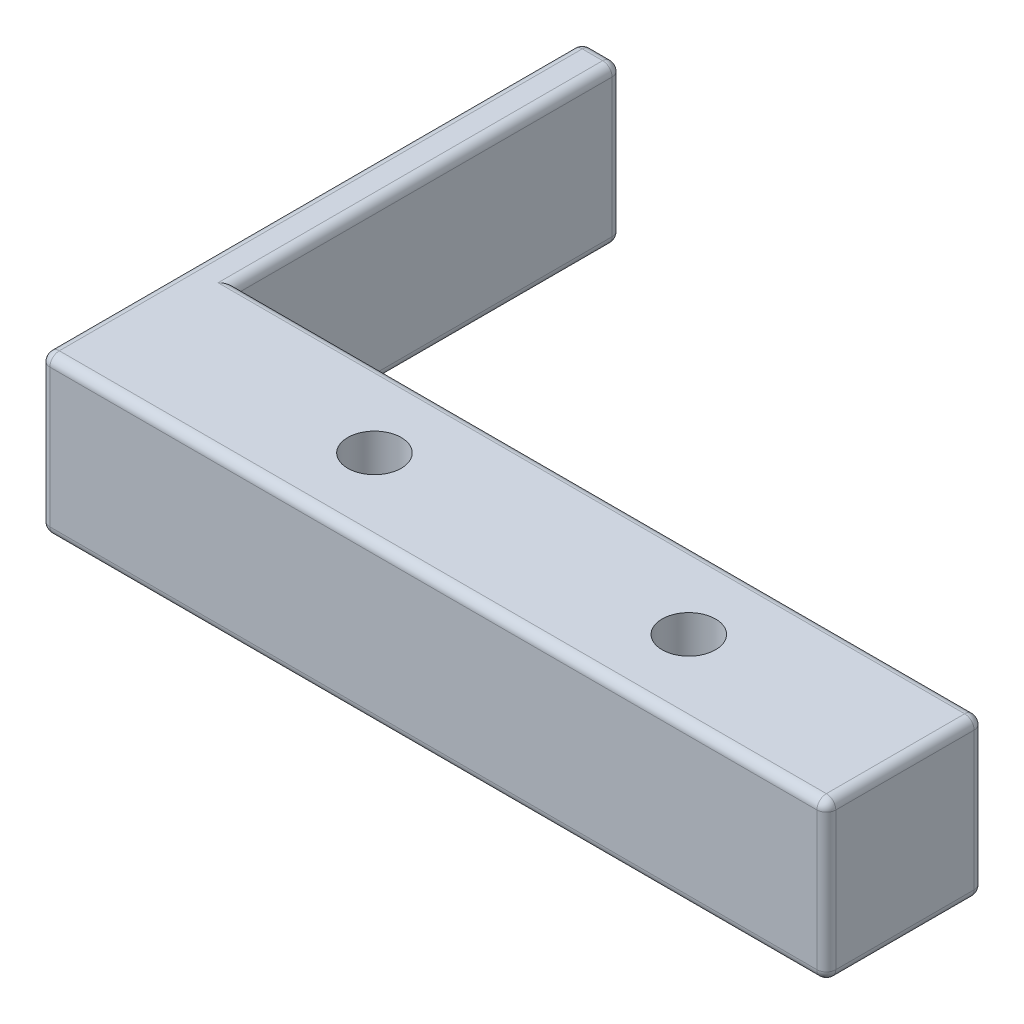
ISO-10303-21;
HEADER;
FILE_DESCRIPTION(('STEP AP214'),'2;1');
FILE_NAME('part.step','',(''),(''),'','','');
FILE_SCHEMA(('AUTOMOTIVE_DESIGN { 1 0 10303 214 1 1 1 1 }'));
ENDSEC;
DATA;
#1=APPLICATION_CONTEXT('core data for automotive mechanical design processes');
#2=APPLICATION_PROTOCOL_DEFINITION('international standard','automotive_design',2000,#1);
#3=PRODUCT_CONTEXT('',#1,'mechanical');
#4=PRODUCT('Part','Part','',(#3));
#5=PRODUCT_RELATED_PRODUCT_CATEGORY('part','',(#4));
#6=PRODUCT_DEFINITION_FORMATION('','',#4);
#7=PRODUCT_DEFINITION_CONTEXT('part definition',#1,'design');
#8=PRODUCT_DEFINITION('design','',#6,#7);
#9=PRODUCT_DEFINITION_SHAPE('','',#8);
#10=(LENGTH_UNIT() NAMED_UNIT(*) SI_UNIT(.MILLI.,.METRE.));
#11=(NAMED_UNIT(*) PLANE_ANGLE_UNIT() SI_UNIT($,.RADIAN.));
#12=(NAMED_UNIT(*) SI_UNIT($,.STERADIAN.) SOLID_ANGLE_UNIT());
#13=UNCERTAINTY_MEASURE_WITH_UNIT(LENGTH_MEASURE(1.E-05),#10,'distance_accuracy_value','');
#14=(GEOMETRIC_REPRESENTATION_CONTEXT(3) GLOBAL_UNCERTAINTY_ASSIGNED_CONTEXT((#13)) GLOBAL_UNIT_ASSIGNED_CONTEXT((#10,
#11,#12)) REPRESENTATION_CONTEXT('',''));
#15=CARTESIAN_POINT('',(0.,0.,0.));
#16=DIRECTION('',(0.,0.,1.));
#17=DIRECTION('',(1.,0.,0.));
#18=AXIS2_PLACEMENT_3D('',#15,#16,#17);
#19=CARTESIAN_POINT('',(42.8625,12.7,-6.35));
#20=DIRECTION('',(0.,-1.,0.));
#21=DIRECTION('',(0.,0.,-1.));
#22=AXIS2_PLACEMENT_3D('',#19,#20,#21);
#23=CYLINDRICAL_SURFACE('',#22,2.159);
#24=CARTESIAN_POINT('',(42.8625,12.7,-6.35));
#25=DIRECTION('',(0.,1.,0.));
#26=DIRECTION('',(0.,0.,1.));
#27=AXIS2_PLACEMENT_3D('',#24,#25,#26);
#28=CIRCLE('',#27,2.159);
#29=CARTESIAN_POINT('',(42.8625,12.7,-4.191));
#30=VERTEX_POINT('',#29);
#31=EDGE_CURVE('E267',#30,#30,#28,.T.);
#32=ORIENTED_EDGE('',*,*,#31,.T.);
#33=EDGE_LOOP('',(#32));
#34=FACE_BOUND('',#33,.T.);
#35=CARTESIAN_POINT('',(42.8625,3.81,-6.35));
#36=DIRECTION('',(0.,-1.,0.));
#37=DIRECTION('',(0.,0.,-1.));
#38=AXIS2_PLACEMENT_3D('',#35,#36,#37);
#39=CIRCLE('',#38,2.159);
#40=CARTESIAN_POINT('',(42.8625,3.81,-8.509));
#41=VERTEX_POINT('',#40);
#42=EDGE_CURVE('E268',#41,#41,#39,.T.);
#43=ORIENTED_EDGE('',*,*,#42,.T.);
#44=EDGE_LOOP('',(#43));
#45=FACE_BOUND('',#44,.T.);
#46=ADVANCED_FACE('F33',(#34,#45),#23,.F.);
#47=CARTESIAN_POINT('',(17.4625,12.7,-6.35));
#48=DIRECTION('',(0.,-1.,0.));
#49=DIRECTION('',(0.,0.,-1.));
#50=AXIS2_PLACEMENT_3D('',#47,#48,#49);
#51=CYLINDRICAL_SURFACE('',#50,2.159);
#52=CARTESIAN_POINT('',(17.4625,12.7,-6.35));
#53=DIRECTION('',(0.,1.,0.));
#54=DIRECTION('',(0.,0.,1.));
#55=AXIS2_PLACEMENT_3D('',#52,#53,#54);
#56=CIRCLE('',#55,2.159);
#57=CARTESIAN_POINT('',(17.4625,12.7,-4.191));
#58=VERTEX_POINT('',#57);
#59=EDGE_CURVE('E264',#58,#58,#56,.T.);
#60=ORIENTED_EDGE('',*,*,#59,.T.);
#61=EDGE_LOOP('',(#60));
#62=FACE_BOUND('',#61,.T.);
#63=CARTESIAN_POINT('',(17.4625,3.81,-6.35));
#64=DIRECTION('',(0.,-1.,0.));
#65=DIRECTION('',(0.,0.,-1.));
#66=AXIS2_PLACEMENT_3D('',#63,#64,#65);
#67=CIRCLE('',#66,2.159);
#68=CARTESIAN_POINT('',(17.4625,3.81,-8.509));
#69=VERTEX_POINT('',#68);
#70=EDGE_CURVE('E261',#69,#69,#67,.T.);
#71=ORIENTED_EDGE('',*,*,#70,.T.);
#72=EDGE_LOOP('',(#71));
#73=FACE_BOUND('',#72,.T.);
#74=ADVANCED_FACE('F478',(#62,#73),#51,.F.);
#75=CARTESIAN_POINT('',(0.,12.7,0.));
#76=DIRECTION('',(0.,1.,0.));
#77=DIRECTION('',(0.,0.,1.));
#78=AXIS2_PLACEMENT_3D('',#75,#76,#77);
#79=PLANE('',#78);
#80=DIRECTION('',(0.,0.,-1.));
#81=VECTOR('',#80,1.);
#82=CARTESIAN_POINT('',(-0.761999999999997,12.7,-43.7752593089877));
#83=LINE('',#82,#81);
#84=CARTESIAN_POINT('',(-0.761999999999999,12.7,-11.938));
#85=VERTEX_POINT('',#84);
#86=CARTESIAN_POINT('',(-0.761999999999997,12.7,-43.0132593089877));
#87=VERTEX_POINT('',#86);
#88=EDGE_CURVE('E304',#85,#87,#83,.T.);
#89=ORIENTED_EDGE('',*,*,#88,.T.);
#90=DIRECTION('',(1.,0.,0.));
#91=VECTOR('',#90,1.);
#92=CARTESIAN_POINT('',(-3.175,12.7,-43.0132593089877));
#93=LINE('',#92,#91);
#94=CARTESIAN_POINT('',(-2.413,12.7,-43.0132593089877));
#95=VERTEX_POINT('',#94);
#96=EDGE_CURVE('E314',#87,#95,#93,.F.);
#97=ORIENTED_EDGE('',*,*,#96,.T.);
#98=DIRECTION('',(0.,0.,-1.));
#99=VECTOR('',#98,1.);
#100=CARTESIAN_POINT('',(-2.413,12.7,0.));
#101=LINE('',#100,#99);
#102=CARTESIAN_POINT('',(-2.413,12.7,-0.762));
#103=VERTEX_POINT('',#102);
#104=EDGE_CURVE('E312',#95,#103,#101,.F.);
#105=ORIENTED_EDGE('',*,*,#104,.T.);
#106=DIRECTION('',(1.,0.,0.));
#107=VECTOR('',#106,1.);
#108=CARTESIAN_POINT('',(60.325,12.7,-0.761999999999999));
#109=LINE('',#108,#107);
#110=CARTESIAN_POINT('',(59.563,12.7,-0.761999999999999));
#111=VERTEX_POINT('',#110);
#112=EDGE_CURVE('E310',#103,#111,#109,.T.);
#113=ORIENTED_EDGE('',*,*,#112,.T.);
#114=DIRECTION('',(0.,0.,-1.));
#115=VECTOR('',#114,1.);
#116=CARTESIAN_POINT('',(59.563,12.7,-12.7));
#117=LINE('',#116,#115);
#118=CARTESIAN_POINT('',(59.563,12.7,-11.938));
#119=VERTEX_POINT('',#118);
#120=EDGE_CURVE('E308',#111,#119,#117,.T.);
#121=ORIENTED_EDGE('',*,*,#120,.T.);
#122=DIRECTION('',(-1.,0.,0.));
#123=VECTOR('',#122,1.);
#124=CARTESIAN_POINT('',(0.,12.7,-11.938));
#125=LINE('',#124,#123);
#126=EDGE_CURVE('E306',#119,#85,#125,.T.);
#127=ORIENTED_EDGE('',*,*,#126,.T.);
#128=EDGE_LOOP('',(#89,#97,#105,#113,#121,#127));
#129=FACE_BOUND('',#128,.T.);
#130=ORIENTED_EDGE('',*,*,#31,.F.);
#131=EDGE_LOOP('',(#130));
#132=FACE_BOUND('',#131,.T.);
#133=ORIENTED_EDGE('',*,*,#59,.F.);
#134=EDGE_LOOP('',(#133));
#135=FACE_BOUND('',#134,.T.);
#136=ADVANCED_FACE('F407',(#129,#132,#135),#79,.T.);
#137=CARTESIAN_POINT('',(0.,0.,0.));
#138=DIRECTION('',(0.,1.,0.));
#139=DIRECTION('',(0.,0.,1.));
#140=AXIS2_PLACEMENT_3D('',#137,#138,#139);
#141=PLANE('',#140);
#142=CARTESIAN_POINT('',(17.4625,0.,-6.35));
#143=DIRECTION('',(0.,1.,0.));
#144=DIRECTION('',(0.,0.,1.));
#145=AXIS2_PLACEMENT_3D('',#142,#143,#144);
#146=CIRCLE('',#145,4.318);
#147=CARTESIAN_POINT('',(17.4625,0.,-2.032));
#148=VERTEX_POINT('',#147);
#149=EDGE_CURVE('E289',#148,#148,#146,.T.);
#150=ORIENTED_EDGE('',*,*,#149,.T.);
#151=EDGE_LOOP('',(#150));
#152=FACE_BOUND('',#151,.T.);
#153=CARTESIAN_POINT('',(42.8625,0.,-6.35));
#154=DIRECTION('',(0.,1.,0.));
#155=DIRECTION('',(0.,0.,1.));
#156=AXIS2_PLACEMENT_3D('',#153,#154,#155);
#157=CIRCLE('',#156,4.31800000000001);
#158=CARTESIAN_POINT('',(42.8625,0.,-2.03199999999999));
#159=VERTEX_POINT('',#158);
#160=EDGE_CURVE('E286',#159,#159,#157,.T.);
#161=ORIENTED_EDGE('',*,*,#160,.T.);
#162=EDGE_LOOP('',(#161));
#163=FACE_BOUND('',#162,.T.);
#164=DIRECTION('',(1.,0.,0.));
#165=VECTOR('',#164,1.);
#166=CARTESIAN_POINT('',(0.,0.,-0.762));
#167=LINE('',#166,#165);
#168=CARTESIAN_POINT('',(59.563,0.,-0.761999999999999));
#169=VERTEX_POINT('',#168);
#170=CARTESIAN_POINT('',(-2.413,0.,-0.762));
#171=VERTEX_POINT('',#170);
#172=EDGE_CURVE('E282',#169,#171,#167,.F.);
#173=ORIENTED_EDGE('',*,*,#172,.T.);
#174=DIRECTION('',(0.,0.,1.));
#175=VECTOR('',#174,1.);
#176=CARTESIAN_POINT('',(-2.413,0.,-43.7752593089877));
#177=LINE('',#176,#175);
#178=CARTESIAN_POINT('',(-2.413,0.,-43.0132593089877));
#179=VERTEX_POINT('',#178);
#180=EDGE_CURVE('E284',#171,#179,#177,.F.);
#181=ORIENTED_EDGE('',*,*,#180,.T.);
#182=DIRECTION('',(1.,0.,0.));
#183=VECTOR('',#182,1.);
#184=CARTESIAN_POINT('',(0.,0.,-43.0132593089877));
#185=LINE('',#184,#183);
#186=CARTESIAN_POINT('',(-0.761999999999997,0.,-43.0132593089877));
#187=VERTEX_POINT('',#186);
#188=EDGE_CURVE('E157',#179,#187,#185,.T.);
#189=ORIENTED_EDGE('',*,*,#188,.T.);
#190=DIRECTION('',(0.,0.,1.));
#191=VECTOR('',#190,1.);
#192=CARTESIAN_POINT('',(-0.762,0.,0.));
#193=LINE('',#192,#191);
#194=CARTESIAN_POINT('',(-0.761999999999999,0.,-11.938));
#195=VERTEX_POINT('',#194);
#196=EDGE_CURVE('E151',#187,#195,#193,.T.);
#197=ORIENTED_EDGE('',*,*,#196,.T.);
#198=DIRECTION('',(-1.,0.,0.));
#199=VECTOR('',#198,1.);
#200=CARTESIAN_POINT('',(0.,0.,-11.938));
#201=LINE('',#200,#199);
#202=CARTESIAN_POINT('',(59.563,0.,-11.938));
#203=VERTEX_POINT('',#202);
#204=EDGE_CURVE('E154',#195,#203,#201,.F.);
#205=ORIENTED_EDGE('',*,*,#204,.T.);
#206=DIRECTION('',(0.,0.,-1.));
#207=VECTOR('',#206,1.);
#208=CARTESIAN_POINT('',(59.563,0.,0.));
#209=LINE('',#208,#207);
#210=EDGE_CURVE('E161',#203,#169,#209,.F.);
#211=ORIENTED_EDGE('',*,*,#210,.T.);
#212=EDGE_LOOP('',(#173,#181,#189,#197,#205,#211));
#213=FACE_BOUND('',#212,.T.);
#214=ADVANCED_FACE('F153',(#152,#163,#213),#141,.F.);
#215=CARTESIAN_POINT('',(0.,12.7,0.));
#216=DIRECTION('',(0.,0.,-1.));
#217=DIRECTION('',(-1.,0.,0.));
#218=AXIS2_PLACEMENT_3D('',#215,#216,#217);
#219=PLANE('',#218);
#220=DIRECTION('',(0.,1.,0.));
#221=VECTOR('',#220,1.);
#222=CARTESIAN_POINT('',(-2.413,0.,0.));
#223=LINE('',#222,#221);
#224=CARTESIAN_POINT('',(-2.413,11.938,0.));
#225=VERTEX_POINT('',#224);
#226=CARTESIAN_POINT('',(-2.413,0.762000000000001,0.));
#227=VERTEX_POINT('',#226);
#228=EDGE_CURVE('E336',#225,#227,#223,.F.);
#229=ORIENTED_EDGE('',*,*,#228,.T.);
#230=DIRECTION('',(1.,0.,0.));
#231=VECTOR('',#230,1.);
#232=CARTESIAN_POINT('',(0.,0.762000000000001,0.));
#233=LINE('',#232,#231);
#234=CARTESIAN_POINT('',(59.563,0.762000000000001,0.));
#235=VERTEX_POINT('',#234);
#236=EDGE_CURVE('E339',#227,#235,#233,.T.);
#237=ORIENTED_EDGE('',*,*,#236,.T.);
#238=DIRECTION('',(0.,-1.,0.));
#239=VECTOR('',#238,1.);
#240=CARTESIAN_POINT('',(59.563,12.7,0.));
#241=LINE('',#240,#239);
#242=CARTESIAN_POINT('',(59.563,11.938,0.));
#243=VERTEX_POINT('',#242);
#244=EDGE_CURVE('E334',#235,#243,#241,.F.);
#245=ORIENTED_EDGE('',*,*,#244,.T.);
#246=DIRECTION('',(1.,0.,0.));
#247=VECTOR('',#246,1.);
#248=CARTESIAN_POINT('',(-3.175,11.938,0.));
#249=LINE('',#248,#247);
#250=EDGE_CURVE('E332',#243,#225,#249,.F.);
#251=ORIENTED_EDGE('',*,*,#250,.T.);
#252=EDGE_LOOP('',(#229,#237,#245,#251));
#253=FACE_BOUND('',#252,.T.);
#254=ADVANCED_FACE('F431',(#253),#219,.F.);
#255=CARTESIAN_POINT('',(60.325,12.7,-12.7));
#256=DIRECTION('',(-1.,0.,0.));
#257=DIRECTION('',(0.,0.,1.));
#258=AXIS2_PLACEMENT_3D('',#255,#256,#257);
#259=PLANE('',#258);
#260=DIRECTION('',(0.,-1.,0.));
#261=VECTOR('',#260,1.);
#262=CARTESIAN_POINT('',(60.325,12.7,-0.761999999999999));
#263=LINE('',#262,#261);
#264=CARTESIAN_POINT('',(60.325,11.938,-0.761999999999999));
#265=VERTEX_POINT('',#264);
#266=CARTESIAN_POINT('',(60.325,0.762000000000001,-0.761999999999999));
#267=VERTEX_POINT('',#266);
#268=EDGE_CURVE('E345',#265,#267,#263,.T.);
#269=ORIENTED_EDGE('',*,*,#268,.T.);
#270=DIRECTION('',(0.,0.,-1.));
#271=VECTOR('',#270,1.);
#272=CARTESIAN_POINT('',(60.325,0.762000000000001,-12.7));
#273=LINE('',#272,#271);
#274=CARTESIAN_POINT('',(60.325,0.762000000000001,-11.938));
#275=VERTEX_POINT('',#274);
#276=EDGE_CURVE('E348',#267,#275,#273,.T.);
#277=ORIENTED_EDGE('',*,*,#276,.T.);
#278=DIRECTION('',(0.,-1.,0.));
#279=VECTOR('',#278,1.);
#280=CARTESIAN_POINT('',(60.325,12.7,-11.938));
#281=LINE('',#280,#279);
#282=CARTESIAN_POINT('',(60.325,11.938,-11.938));
#283=VERTEX_POINT('',#282);
#284=EDGE_CURVE('E343',#275,#283,#281,.F.);
#285=ORIENTED_EDGE('',*,*,#284,.T.);
#286=DIRECTION('',(0.,0.,-1.));
#287=VECTOR('',#286,1.);
#288=CARTESIAN_POINT('',(60.325,11.938,0.));
#289=LINE('',#288,#287);
#290=EDGE_CURVE('E341',#283,#265,#289,.F.);
#291=ORIENTED_EDGE('',*,*,#290,.T.);
#292=EDGE_LOOP('',(#269,#277,#285,#291));
#293=FACE_BOUND('',#292,.T.);
#294=ADVANCED_FACE('F495',(#293),#259,.F.);
#295=CARTESIAN_POINT('',(0.,12.7,-12.7));
#296=DIRECTION('',(0.,0.,1.));
#297=DIRECTION('',(1.,0.,0.));
#298=AXIS2_PLACEMENT_3D('',#295,#296,#297);
#299=PLANE('',#298);
#300=DIRECTION('',(0.,-1.,0.));
#301=VECTOR('',#300,1.);
#302=CARTESIAN_POINT('',(0.,12.7,-12.7));
#303=LINE('',#302,#301);
#304=CARTESIAN_POINT('',(0.,11.938,-12.7));
#305=VERTEX_POINT('',#304);
#306=CARTESIAN_POINT('',(0.,0.762000000000001,-12.7));
#307=VERTEX_POINT('',#306);
#308=EDGE_CURVE('E271',#305,#307,#303,.T.);
#309=ORIENTED_EDGE('',*,*,#308,.F.);
#310=DIRECTION('',(-1.,0.,0.));
#311=VECTOR('',#310,1.);
#312=CARTESIAN_POINT('',(60.325,11.938,-12.7));
#313=LINE('',#312,#311);
#314=CARTESIAN_POINT('',(59.563,11.938,-12.7));
#315=VERTEX_POINT('',#314);
#316=EDGE_CURVE('E11',#305,#315,#313,.F.);
#317=ORIENTED_EDGE('',*,*,#316,.T.);
#318=DIRECTION('',(0.,-1.,0.));
#319=VECTOR('',#318,1.);
#320=CARTESIAN_POINT('',(59.563,12.7,-12.7));
#321=LINE('',#320,#319);
#322=CARTESIAN_POINT('',(59.563,0.762000000000001,-12.7));
#323=VERTEX_POINT('',#322);
#324=EDGE_CURVE('E42',#315,#323,#321,.T.);
#325=ORIENTED_EDGE('',*,*,#324,.T.);
#326=DIRECTION('',(-1.,0.,0.));
#327=VECTOR('',#326,1.);
#328=CARTESIAN_POINT('',(0.,0.762000000000001,-12.7));
#329=LINE('',#328,#327);
#330=EDGE_CURVE('E350',#323,#307,#329,.T.);
#331=ORIENTED_EDGE('',*,*,#330,.T.);
#332=EDGE_LOOP('',(#309,#317,#325,#331));
#333=FACE_BOUND('',#332,.T.);
#334=ADVANCED_FACE('F394',(#333),#299,.F.);
#335=CARTESIAN_POINT('',(0.,0.,0.));
#336=DIRECTION('',(-1.,0.,0.));
#337=DIRECTION('',(0.,0.,1.));
#338=AXIS2_PLACEMENT_3D('',#335,#336,#337);
#339=PLANE('',#338);
#340=DIRECTION('',(0.,-1.,0.));
#341=VECTOR('',#340,1.);
#342=CARTESIAN_POINT('',(0.,0.,-43.0132593089877));
#343=LINE('',#342,#341);
#344=CARTESIAN_POINT('',(0.,0.762,-43.0132593089877));
#345=VERTEX_POINT('',#344);
#346=CARTESIAN_POINT('',(0.,11.938,-43.0132593089877));
#347=VERTEX_POINT('',#346);
#348=EDGE_CURVE('E318',#345,#347,#343,.F.);
#349=ORIENTED_EDGE('',*,*,#348,.T.);
#350=DIRECTION('',(0.,0.,-1.));
#351=VECTOR('',#350,1.);
#352=CARTESIAN_POINT('',(0.,11.938,-12.7));
#353=LINE('',#352,#351);
#354=EDGE_CURVE('E321',#347,#305,#353,.F.);
#355=ORIENTED_EDGE('',*,*,#354,.T.);
#356=ORIENTED_EDGE('',*,*,#308,.T.);
#357=DIRECTION('',(0.,0.,1.));
#358=VECTOR('',#357,1.);
#359=CARTESIAN_POINT('',(0.,0.762,0.));
#360=LINE('',#359,#358);
#361=EDGE_CURVE('E175',#307,#345,#360,.F.);
#362=ORIENTED_EDGE('',*,*,#361,.T.);
#363=EDGE_LOOP('',(#349,#355,#356,#362));
#364=FACE_BOUND('',#363,.T.);
#365=ADVANCED_FACE('F392',(#364),#339,.F.);
#366=CARTESIAN_POINT('',(-3.175,12.7,-43.7752593089877));
#367=DIRECTION('',(0.,0.,1.));
#368=DIRECTION('',(1.,0.,0.));
#369=AXIS2_PLACEMENT_3D('',#366,#367,#368);
#370=PLANE('',#369);
#371=DIRECTION('',(1.,0.,0.));
#372=VECTOR('',#371,1.);
#373=CARTESIAN_POINT('',(0.,11.938,-43.7752593089877));
#374=LINE('',#373,#372);
#375=CARTESIAN_POINT('',(-2.413,11.938,-43.7752593089877));
#376=VERTEX_POINT('',#375);
#377=CARTESIAN_POINT('',(-0.761999999999997,11.938,-43.7752593089877));
#378=VERTEX_POINT('',#377);
#379=EDGE_CURVE('E297',#376,#378,#374,.T.);
#380=ORIENTED_EDGE('',*,*,#379,.T.);
#381=DIRECTION('',(0.,-1.,0.));
#382=VECTOR('',#381,1.);
#383=CARTESIAN_POINT('',(-0.761999999999997,12.7,-43.7752593089877));
#384=LINE('',#383,#382);
#385=CARTESIAN_POINT('',(-0.761999999999997,0.762,-43.7752593089877));
#386=VERTEX_POINT('',#385);
#387=EDGE_CURVE('E302',#378,#386,#384,.T.);
#388=ORIENTED_EDGE('',*,*,#387,.T.);
#389=DIRECTION('',(1.,0.,0.));
#390=VECTOR('',#389,1.);
#391=CARTESIAN_POINT('',(-3.175,0.762000000000001,-43.7752593089877));
#392=LINE('',#391,#390);
#393=CARTESIAN_POINT('',(-2.413,0.762,-43.7752593089877));
#394=VERTEX_POINT('',#393);
#395=EDGE_CURVE('E299',#386,#394,#392,.F.);
#396=ORIENTED_EDGE('',*,*,#395,.T.);
#397=DIRECTION('',(0.,-1.,0.));
#398=VECTOR('',#397,1.);
#399=CARTESIAN_POINT('',(-2.413,12.7,-43.7752593089877));
#400=LINE('',#399,#398);
#401=EDGE_CURVE('E295',#394,#376,#400,.F.);
#402=ORIENTED_EDGE('',*,*,#401,.T.);
#403=EDGE_LOOP('',(#380,#388,#396,#402));
#404=FACE_BOUND('',#403,.T.);
#405=ADVANCED_FACE('F379',(#404),#370,.F.);
#406=CARTESIAN_POINT('',(-3.175,0.,0.));
#407=DIRECTION('',(-1.,0.,0.));
#408=DIRECTION('',(0.,0.,1.));
#409=AXIS2_PLACEMENT_3D('',#406,#407,#408);
#410=PLANE('',#409);
#411=DIRECTION('',(0.,0.,1.));
#412=VECTOR('',#411,1.);
#413=CARTESIAN_POINT('',(-3.175,0.762,0.));
#414=LINE('',#413,#412);
#415=CARTESIAN_POINT('',(-3.175,0.762,-43.0132593089877));
#416=VERTEX_POINT('',#415);
#417=CARTESIAN_POINT('',(-3.175,0.762,-0.762));
#418=VERTEX_POINT('',#417);
#419=EDGE_CURVE('E327',#416,#418,#414,.T.);
#420=ORIENTED_EDGE('',*,*,#419,.T.);
#421=DIRECTION('',(0.,1.,0.));
#422=VECTOR('',#421,1.);
#423=CARTESIAN_POINT('',(-3.175,12.7,-0.762));
#424=LINE('',#423,#422);
#425=CARTESIAN_POINT('',(-3.175,11.938,-0.762));
#426=VERTEX_POINT('',#425);
#427=EDGE_CURVE('E329',#418,#426,#424,.T.);
#428=ORIENTED_EDGE('',*,*,#427,.T.);
#429=DIRECTION('',(0.,0.,-1.));
#430=VECTOR('',#429,1.);
#431=CARTESIAN_POINT('',(-3.175,11.938,0.));
#432=LINE('',#431,#430);
#433=CARTESIAN_POINT('',(-3.175,11.938,-43.0132593089877));
#434=VERTEX_POINT('',#433);
#435=EDGE_CURVE('E325',#426,#434,#432,.T.);
#436=ORIENTED_EDGE('',*,*,#435,.T.);
#437=DIRECTION('',(0.,-1.,0.));
#438=VECTOR('',#437,1.);
#439=CARTESIAN_POINT('',(-3.175,0.,-43.0132593089877));
#440=LINE('',#439,#438);
#441=EDGE_CURVE('E323',#434,#416,#440,.T.);
#442=ORIENTED_EDGE('',*,*,#441,.T.);
#443=EDGE_LOOP('',(#420,#428,#436,#442));
#444=FACE_BOUND('',#443,.T.);
#445=ADVANCED_FACE('F464',(#444),#410,.T.);
#446=CARTESIAN_POINT('',(17.4625,3.81,-6.35));
#447=DIRECTION('',(0.,-1.,0.));
#448=DIRECTION('',(0.,0.,-1.));
#449=AXIS2_PLACEMENT_3D('',#446,#447,#448);
#450=CYLINDRICAL_SURFACE('',#449,3.556);
#451=CARTESIAN_POINT('',(17.4625,0.762,-6.35));
#452=DIRECTION('',(0.,1.,0.));
#453=DIRECTION('',(0.,0.,1.));
#454=AXIS2_PLACEMENT_3D('',#451,#452,#453);
#455=CIRCLE('',#454,3.556);
#456=CARTESIAN_POINT('',(17.4625,0.762,-2.794));
#457=VERTEX_POINT('',#456);
#458=EDGE_CURVE('E172',#457,#457,#455,.F.);
#459=ORIENTED_EDGE('',*,*,#458,.T.);
#460=EDGE_LOOP('',(#459));
#461=FACE_BOUND('',#460,.T.);
#462=CARTESIAN_POINT('',(17.4625,3.81,-6.35));
#463=DIRECTION('',(0.,-1.,0.));
#464=DIRECTION('',(0.,0.,-1.));
#465=AXIS2_PLACEMENT_3D('',#462,#463,#464);
#466=CIRCLE('',#465,3.556);
#467=CARTESIAN_POINT('',(17.4625,3.81,-9.906));
#468=VERTEX_POINT('',#467);
#469=EDGE_CURVE('E250',#468,#468,#466,.T.);
#470=ORIENTED_EDGE('',*,*,#469,.F.);
#471=EDGE_LOOP('',(#470));
#472=FACE_BOUND('',#471,.T.);
#473=ADVANCED_FACE('F466',(#461,#472),#450,.F.);
#474=CARTESIAN_POINT('',(17.4625,3.81,-6.35));
#475=DIRECTION('',(0.,-1.,0.));
#476=DIRECTION('',(0.,0.,-1.));
#477=AXIS2_PLACEMENT_3D('',#474,#475,#476);
#478=PLANE('',#477);
#479=ORIENTED_EDGE('',*,*,#70,.F.);
#480=EDGE_LOOP('',(#479));
#481=FACE_BOUND('',#480,.T.);
#482=ORIENTED_EDGE('',*,*,#469,.T.);
#483=EDGE_LOOP('',(#482));
#484=FACE_BOUND('',#483,.T.);
#485=ADVANCED_FACE('F472',(#481,#484),#478,.T.);
#486=CARTESIAN_POINT('',(42.8625,3.81,-6.35));
#487=DIRECTION('',(0.,-1.,0.));
#488=DIRECTION('',(0.,0.,-1.));
#489=AXIS2_PLACEMENT_3D('',#486,#487,#488);
#490=CYLINDRICAL_SURFACE('',#489,3.55600000000001);
#491=CARTESIAN_POINT('',(42.8625,0.762,-6.35));
#492=DIRECTION('',(0.,1.,0.));
#493=DIRECTION('',(0.,0.,1.));
#494=AXIS2_PLACEMENT_3D('',#491,#492,#493);
#495=CIRCLE('',#494,3.55600000000001);
#496=CARTESIAN_POINT('',(42.8625,0.762,-2.79399999999999));
#497=VERTEX_POINT('',#496);
#498=EDGE_CURVE('E292',#497,#497,#495,.F.);
#499=ORIENTED_EDGE('',*,*,#498,.T.);
#500=EDGE_LOOP('',(#499));
#501=FACE_BOUND('',#500,.T.);
#502=CARTESIAN_POINT('',(42.8625,3.81,-6.35));
#503=DIRECTION('',(0.,-1.,0.));
#504=DIRECTION('',(0.,0.,-1.));
#505=AXIS2_PLACEMENT_3D('',#502,#503,#504);
#506=CIRCLE('',#505,3.55600000000001);
#507=CARTESIAN_POINT('',(42.8625,3.81,-9.90600000000001));
#508=VERTEX_POINT('',#507);
#509=EDGE_CURVE('E256',#508,#508,#506,.T.);
#510=ORIENTED_EDGE('',*,*,#509,.F.);
#511=EDGE_LOOP('',(#510));
#512=FACE_BOUND('',#511,.T.);
#513=ADVANCED_FACE('F585',(#501,#512),#490,.F.);
#514=CARTESIAN_POINT('',(42.8625,3.81,-6.35));
#515=DIRECTION('',(0.,-1.,0.));
#516=DIRECTION('',(0.,0.,-1.));
#517=AXIS2_PLACEMENT_3D('',#514,#515,#516);
#518=PLANE('',#517);
#519=ORIENTED_EDGE('',*,*,#42,.F.);
#520=EDGE_LOOP('',(#519));
#521=FACE_BOUND('',#520,.T.);
#522=ORIENTED_EDGE('',*,*,#509,.T.);
#523=EDGE_LOOP('',(#522));
#524=FACE_BOUND('',#523,.T.);
#525=ADVANCED_FACE('F505',(#521,#524),#518,.T.);
#526=CARTESIAN_POINT('',(17.4625,0.762,-6.35));
#527=DIRECTION('',(0.,1.,0.));
#528=DIRECTION('',(0.,0.,1.));
#529=AXIS2_PLACEMENT_3D('',#526,#527,#528);
#530=TOROIDAL_SURFACE('',#529,4.318,0.762);
#531=ORIENTED_EDGE('',*,*,#149,.F.);
#532=EDGE_LOOP('',(#531));
#533=FACE_BOUND('',#532,.T.);
#534=ORIENTED_EDGE('',*,*,#458,.F.);
#535=EDGE_LOOP('',(#534));
#536=FACE_BOUND('',#535,.T.);
#537=ADVANCED_FACE('F501',(#533,#536),#530,.T.);
#538=CARTESIAN_POINT('',(42.8625,0.762,-6.35));
#539=DIRECTION('',(0.,1.,0.));
#540=DIRECTION('',(0.,0.,1.));
#541=AXIS2_PLACEMENT_3D('',#538,#539,#540);
#542=TOROIDAL_SURFACE('',#541,4.31800000000001,0.762);
#543=ORIENTED_EDGE('',*,*,#160,.F.);
#544=EDGE_LOOP('',(#543));
#545=FACE_BOUND('',#544,.T.);
#546=ORIENTED_EDGE('',*,*,#498,.F.);
#547=EDGE_LOOP('',(#546));
#548=FACE_BOUND('',#547,.T.);
#549=ADVANCED_FACE('F504',(#545,#548),#542,.T.);
#550=CARTESIAN_POINT('',(59.563,11.938,-0.761999999999999));
#551=DIRECTION('',(0.,0.,1.));
#552=DIRECTION('',(1.,0.,0.));
#553=AXIS2_PLACEMENT_3D('',#550,#551,#552);
#554=SPHERICAL_SURFACE('',#553,0.762);
#555=CARTESIAN_POINT('',(59.563,11.938,-0.761999999999999));
#556=DIRECTION('',(0.,1.,0.));
#557=DIRECTION('',(0.,0.,1.));
#558=AXIS2_PLACEMENT_3D('',#555,#556,#557);
#559=CIRCLE('',#558,0.762);
#560=EDGE_CURVE('E240',#265,#243,#559,.F.);
#561=ORIENTED_EDGE('',*,*,#560,.F.);
#562=CARTESIAN_POINT('',(59.563,11.938,-0.761999999999999));
#563=DIRECTION('',(0.,0.,1.));
#564=DIRECTION('',(0.,-1.,0.));
#565=AXIS2_PLACEMENT_3D('',#562,#563,#564);
#566=CIRCLE('',#565,0.762);
#567=EDGE_CURVE('E37',#111,#265,#566,.F.);
#568=ORIENTED_EDGE('',*,*,#567,.F.);
#569=CARTESIAN_POINT('',(59.563,11.938,-0.761999999999999));
#570=DIRECTION('',(1.,0.,0.));
#571=DIRECTION('',(0.,0.,-1.));
#572=AXIS2_PLACEMENT_3D('',#569,#570,#571);
#573=CIRCLE('',#572,0.762);
#574=EDGE_CURVE('E242',#243,#111,#573,.F.);
#575=ORIENTED_EDGE('',*,*,#574,.F.);
#576=EDGE_LOOP('',(#561,#568,#575));
#577=FACE_BOUND('',#576,.T.);
#578=ADVANCED_FACE('F35',(#577),#554,.T.);
#579=CARTESIAN_POINT('',(59.563,11.938,0.));
#580=DIRECTION('',(0.,0.,1.));
#581=DIRECTION('',(1.,0.,0.));
#582=AXIS2_PLACEMENT_3D('',#579,#580,#581);
#583=CYLINDRICAL_SURFACE('',#582,0.762);
#584=ORIENTED_EDGE('',*,*,#567,.T.);
#585=ORIENTED_EDGE('',*,*,#290,.F.);
#586=CARTESIAN_POINT('',(59.563,11.938,-11.938));
#587=DIRECTION('',(0.,0.,-1.));
#588=DIRECTION('',(-1.,0.,0.));
#589=AXIS2_PLACEMENT_3D('',#586,#587,#588);
#590=CIRCLE('',#589,0.762);
#591=EDGE_CURVE('E237',#119,#283,#590,.T.);
#592=ORIENTED_EDGE('',*,*,#591,.F.);
#593=ORIENTED_EDGE('',*,*,#120,.F.);
#594=EDGE_LOOP('',(#584,#585,#592,#593));
#595=FACE_BOUND('',#594,.T.);
#596=ADVANCED_FACE('F439',(#595),#583,.T.);
#597=CARTESIAN_POINT('',(0.,11.938,-0.762));
#598=DIRECTION('',(-1.,0.,0.));
#599=DIRECTION('',(0.,0.,1.));
#600=AXIS2_PLACEMENT_3D('',#597,#598,#599);
#601=CYLINDRICAL_SURFACE('',#600,0.762);
#602=ORIENTED_EDGE('',*,*,#574,.T.);
#603=ORIENTED_EDGE('',*,*,#112,.F.);
#604=CARTESIAN_POINT('',(-2.413,11.938,-0.762));
#605=DIRECTION('',(-1.,0.,0.));
#606=DIRECTION('',(0.,0.,1.));
#607=AXIS2_PLACEMENT_3D('',#604,#605,#606);
#608=CIRCLE('',#607,0.762);
#609=EDGE_CURVE('E234',#225,#103,#608,.T.);
#610=ORIENTED_EDGE('',*,*,#609,.F.);
#611=ORIENTED_EDGE('',*,*,#250,.F.);
#612=EDGE_LOOP('',(#602,#603,#610,#611));
#613=FACE_BOUND('',#612,.T.);
#614=ADVANCED_FACE('F420',(#613),#601,.T.);
#615=CARTESIAN_POINT('',(59.563,12.7,-0.761999999999999));
#616=DIRECTION('',(0.,-1.,0.));
#617=DIRECTION('',(0.,0.,-1.));
#618=AXIS2_PLACEMENT_3D('',#615,#616,#617);
#619=CYLINDRICAL_SURFACE('',#618,0.762);
#620=ORIENTED_EDGE('',*,*,#560,.T.);
#621=ORIENTED_EDGE('',*,*,#244,.F.);
#622=CARTESIAN_POINT('',(59.563,0.762000000000001,-0.761999999999999));
#623=DIRECTION('',(0.,-1.,0.));
#624=DIRECTION('',(0.,0.,-1.));
#625=AXIS2_PLACEMENT_3D('',#622,#623,#624);
#626=CIRCLE('',#625,0.762);
#627=EDGE_CURVE('E231',#267,#235,#626,.T.);
#628=ORIENTED_EDGE('',*,*,#627,.F.);
#629=ORIENTED_EDGE('',*,*,#268,.F.);
#630=EDGE_LOOP('',(#620,#621,#628,#629));
#631=FACE_BOUND('',#630,.T.);
#632=ADVANCED_FACE('F436',(#631),#619,.T.);
#633=CARTESIAN_POINT('',(59.563,11.938,-11.938));
#634=DIRECTION('',(0.,0.,1.));
#635=DIRECTION('',(1.,0.,0.));
#636=AXIS2_PLACEMENT_3D('',#633,#634,#635);
#637=SPHERICAL_SURFACE('',#636,0.762);
#638=CARTESIAN_POINT('',(59.563,11.938,-11.938));
#639=DIRECTION('',(1.,0.,0.));
#640=DIRECTION('',(0.,0.,-1.));
#641=AXIS2_PLACEMENT_3D('',#638,#639,#640);
#642=CIRCLE('',#641,0.762);
#643=EDGE_CURVE('E223',#119,#315,#642,.F.);
#644=ORIENTED_EDGE('',*,*,#643,.F.);
#645=ORIENTED_EDGE('',*,*,#591,.T.);
#646=CARTESIAN_POINT('',(59.563,11.938,-11.938));
#647=DIRECTION('',(0.,1.,0.));
#648=DIRECTION('',(0.,0.,1.));
#649=AXIS2_PLACEMENT_3D('',#646,#647,#648);
#650=CIRCLE('',#649,0.762);
#651=EDGE_CURVE('E225',#315,#283,#650,.F.);
#652=ORIENTED_EDGE('',*,*,#651,.F.);
#653=EDGE_LOOP('',(#644,#645,#652));
#654=FACE_BOUND('',#653,.T.);
#655=ADVANCED_FACE('F441',(#654),#637,.T.);
#656=CARTESIAN_POINT('',(-2.413,11.938,-0.762));
#657=DIRECTION('',(0.,0.,1.));
#658=DIRECTION('',(1.,0.,0.));
#659=AXIS2_PLACEMENT_3D('',#656,#657,#658);
#660=SPHERICAL_SURFACE('',#659,0.762);
#661=CARTESIAN_POINT('',(-2.413,11.938,-0.762));
#662=DIRECTION('',(0.,1.,0.));
#663=DIRECTION('',(0.,0.,1.));
#664=AXIS2_PLACEMENT_3D('',#661,#662,#663);
#665=CIRCLE('',#664,0.762);
#666=EDGE_CURVE('E217',#225,#426,#665,.F.);
#667=ORIENTED_EDGE('',*,*,#666,.F.);
#668=ORIENTED_EDGE('',*,*,#609,.T.);
#669=CARTESIAN_POINT('',(-2.413,11.938,-0.762));
#670=DIRECTION('',(0.,0.,1.));
#671=DIRECTION('',(1.,0.,0.));
#672=AXIS2_PLACEMENT_3D('',#669,#670,#671);
#673=CIRCLE('',#672,0.762);
#674=EDGE_CURVE('E220',#426,#103,#673,.F.);
#675=ORIENTED_EDGE('',*,*,#674,.F.);
#676=EDGE_LOOP('',(#667,#668,#675));
#677=FACE_BOUND('',#676,.T.);
#678=ADVANCED_FACE('F423',(#677),#660,.T.);
#679=CARTESIAN_POINT('',(59.563,0.762,-0.761999999999999));
#680=DIRECTION('',(0.,0.,1.));
#681=DIRECTION('',(1.,0.,0.));
#682=AXIS2_PLACEMENT_3D('',#679,#680,#681);
#683=SPHERICAL_SURFACE('',#682,0.762);
#684=CARTESIAN_POINT('',(59.563,0.762000000000001,-0.761999999999999));
#685=DIRECTION('',(1.,0.,0.));
#686=DIRECTION('',(0.,0.,-1.));
#687=AXIS2_PLACEMENT_3D('',#684,#685,#686);
#688=CIRCLE('',#687,0.762);
#689=EDGE_CURVE('E214',#169,#235,#688,.F.);
#690=ORIENTED_EDGE('',*,*,#689,.F.);
#691=CARTESIAN_POINT('',(59.563,0.762,-0.761999999999999));
#692=DIRECTION('',(0.,0.,1.));
#693=DIRECTION('',(1.,0.,0.));
#694=AXIS2_PLACEMENT_3D('',#691,#692,#693);
#695=CIRCLE('',#694,0.762);
#696=EDGE_CURVE('E228',#267,#169,#695,.F.);
#697=ORIENTED_EDGE('',*,*,#696,.F.);
#698=ORIENTED_EDGE('',*,*,#627,.T.);
#699=EDGE_LOOP('',(#690,#697,#698));
#700=FACE_BOUND('',#699,.T.);
#701=ADVANCED_FACE('F553',(#700),#683,.T.);
#702=CARTESIAN_POINT('',(59.563,0.762000000000001,-12.7));
#703=DIRECTION('',(0.,0.,-1.));
#704=DIRECTION('',(-1.,0.,0.));
#705=AXIS2_PLACEMENT_3D('',#702,#703,#704);
#706=CYLINDRICAL_SURFACE('',#705,0.762);
#707=ORIENTED_EDGE('',*,*,#696,.T.);
#708=ORIENTED_EDGE('',*,*,#210,.F.);
#709=CARTESIAN_POINT('',(59.563,0.762000000000001,-11.938));
#710=DIRECTION('',(0.,0.,-1.));
#711=DIRECTION('',(-1.,0.,0.));
#712=AXIS2_PLACEMENT_3D('',#709,#710,#711);
#713=CIRCLE('',#712,0.762);
#714=EDGE_CURVE('E211',#275,#203,#713,.T.);
#715=ORIENTED_EDGE('',*,*,#714,.F.);
#716=ORIENTED_EDGE('',*,*,#276,.F.);
#717=EDGE_LOOP('',(#707,#708,#715,#716));
#718=FACE_BOUND('',#717,.T.);
#719=ADVANCED_FACE('F449',(#718),#706,.T.);
#720=CARTESIAN_POINT('',(59.563,12.7,-11.938));
#721=DIRECTION('',(0.,-1.,0.));
#722=DIRECTION('',(0.,0.,-1.));
#723=AXIS2_PLACEMENT_3D('',#720,#721,#722);
#724=CYLINDRICAL_SURFACE('',#723,0.762);
#725=ORIENTED_EDGE('',*,*,#651,.T.);
#726=ORIENTED_EDGE('',*,*,#284,.F.);
#727=CARTESIAN_POINT('',(59.563,0.762000000000001,-11.938));
#728=DIRECTION('',(0.,-1.,0.));
#729=DIRECTION('',(0.,0.,-1.));
#730=AXIS2_PLACEMENT_3D('',#727,#728,#729);
#731=CIRCLE('',#730,0.762);
#732=EDGE_CURVE('E208',#323,#275,#731,.T.);
#733=ORIENTED_EDGE('',*,*,#732,.F.);
#734=ORIENTED_EDGE('',*,*,#324,.F.);
#735=EDGE_LOOP('',(#725,#726,#733,#734));
#736=FACE_BOUND('',#735,.T.);
#737=ADVANCED_FACE('F444',(#736),#724,.T.);
#738=CARTESIAN_POINT('',(0.,11.938,-11.938));
#739=DIRECTION('',(1.,0.,0.));
#740=DIRECTION('',(0.,0.,-1.));
#741=AXIS2_PLACEMENT_3D('',#738,#739,#740);
#742=CYLINDRICAL_SURFACE('',#741,0.762);
#743=ORIENTED_EDGE('',*,*,#643,.T.);
#744=ORIENTED_EDGE('',*,*,#316,.F.);
#745=CARTESIAN_POINT('',(-0.761999999999999,11.938,-11.938));
#746=DIRECTION('',(0.707106781186547,0.,0.707106781186548));
#747=DIRECTION('',(0.707106781186547,0.,-0.707106781186547));
#748=AXIS2_PLACEMENT_3D('',#745,#746,#747);
#749=ELLIPSE('',#748,1.0776307345283,0.762);
#750=EDGE_CURVE('E205',#85,#305,#749,.F.);
#751=ORIENTED_EDGE('',*,*,#750,.F.);
#752=ORIENTED_EDGE('',*,*,#126,.F.);
#753=EDGE_LOOP('',(#743,#744,#751,#752));
#754=FACE_BOUND('',#753,.T.);
#755=ADVANCED_FACE('F397',(#754),#742,.T.);
#756=CARTESIAN_POINT('',(-2.413,11.938,0.));
#757=DIRECTION('',(0.,0.,-1.));
#758=DIRECTION('',(-1.,0.,0.));
#759=AXIS2_PLACEMENT_3D('',#756,#757,#758);
#760=CYLINDRICAL_SURFACE('',#759,0.762);
#761=ORIENTED_EDGE('',*,*,#674,.T.);
#762=ORIENTED_EDGE('',*,*,#104,.F.);
#763=CARTESIAN_POINT('',(-2.413,11.938,-43.0132593089877));
#764=DIRECTION('',(0.,0.,-1.));
#765=DIRECTION('',(-1.,0.,0.));
#766=AXIS2_PLACEMENT_3D('',#763,#764,#765);
#767=CIRCLE('',#766,0.762);
#768=EDGE_CURVE('E200',#434,#95,#767,.T.);
#769=ORIENTED_EDGE('',*,*,#768,.F.);
#770=ORIENTED_EDGE('',*,*,#435,.F.);
#771=EDGE_LOOP('',(#761,#762,#769,#770));
#772=FACE_BOUND('',#771,.T.);
#773=ADVANCED_FACE('F417',(#772),#760,.T.);
#774=CARTESIAN_POINT('',(-2.413,0.,-0.762));
#775=DIRECTION('',(0.,-1.,0.));
#776=DIRECTION('',(0.,0.,-1.));
#777=AXIS2_PLACEMENT_3D('',#774,#775,#776);
#778=CYLINDRICAL_SURFACE('',#777,0.762);
#779=ORIENTED_EDGE('',*,*,#666,.T.);
#780=ORIENTED_EDGE('',*,*,#427,.F.);
#781=CARTESIAN_POINT('',(-2.413,0.762000000000001,-0.762));
#782=DIRECTION('',(0.,-1.,0.));
#783=DIRECTION('',(1.,0.,0.));
#784=AXIS2_PLACEMENT_3D('',#781,#782,#783);
#785=CIRCLE('',#784,0.762);
#786=EDGE_CURVE('E197',#227,#418,#785,.T.);
#787=ORIENTED_EDGE('',*,*,#786,.F.);
#788=ORIENTED_EDGE('',*,*,#228,.F.);
#789=EDGE_LOOP('',(#779,#780,#787,#788));
#790=FACE_BOUND('',#789,.T.);
#791=ADVANCED_FACE('F428',(#790),#778,.T.);
#792=CARTESIAN_POINT('',(0.,0.762000000000001,-0.762));
#793=DIRECTION('',(1.,0.,0.));
#794=DIRECTION('',(0.,0.,-1.));
#795=AXIS2_PLACEMENT_3D('',#792,#793,#794);
#796=CYLINDRICAL_SURFACE('',#795,0.762);
#797=ORIENTED_EDGE('',*,*,#689,.T.);
#798=ORIENTED_EDGE('',*,*,#236,.F.);
#799=CARTESIAN_POINT('',(-2.413,0.762,-0.762));
#800=DIRECTION('',(-1.,0.,0.));
#801=DIRECTION('',(0.,0.,1.));
#802=AXIS2_PLACEMENT_3D('',#799,#800,#801);
#803=CIRCLE('',#802,0.762);
#804=EDGE_CURVE('E195',#171,#227,#803,.T.);
#805=ORIENTED_EDGE('',*,*,#804,.F.);
#806=ORIENTED_EDGE('',*,*,#172,.F.);
#807=EDGE_LOOP('',(#797,#798,#805,#806));
#808=FACE_BOUND('',#807,.T.);
#809=ADVANCED_FACE('F457',(#808),#796,.T.);
#810=CARTESIAN_POINT('',(59.563,0.762,-11.938));
#811=DIRECTION('',(0.,0.,1.));
#812=DIRECTION('',(1.,0.,0.));
#813=AXIS2_PLACEMENT_3D('',#810,#811,#812);
#814=SPHERICAL_SURFACE('',#813,0.762);
#815=ORIENTED_EDGE('',*,*,#732,.T.);
#816=ORIENTED_EDGE('',*,*,#714,.T.);
#817=CARTESIAN_POINT('',(59.563,0.762,-11.938));
#818=DIRECTION('',(1.,0.,0.));
#819=DIRECTION('',(0.,0.,-1.));
#820=AXIS2_PLACEMENT_3D('',#817,#818,#819);
#821=CIRCLE('',#820,0.762);
#822=EDGE_CURVE('E171',#323,#203,#821,.F.);
#823=ORIENTED_EDGE('',*,*,#822,.F.);
#824=EDGE_LOOP('',(#815,#816,#823));
#825=FACE_BOUND('',#824,.T.);
#826=ADVANCED_FACE('F447',(#825),#814,.T.);
#827=CARTESIAN_POINT('',(-0.762,11.938,0.));
#828=DIRECTION('',(0.,0.,1.));
#829=DIRECTION('',(1.,0.,0.));
#830=AXIS2_PLACEMENT_3D('',#827,#828,#829);
#831=CYLINDRICAL_SURFACE('',#830,0.762);
#832=ORIENTED_EDGE('',*,*,#750,.T.);
#833=ORIENTED_EDGE('',*,*,#354,.F.);
#834=CARTESIAN_POINT('',(-0.761999999999997,11.938,-43.0132593089877));
#835=DIRECTION('',(0.,0.,-1.));
#836=DIRECTION('',(-1.,0.,0.));
#837=AXIS2_PLACEMENT_3D('',#834,#835,#836);
#838=CIRCLE('',#837,0.762);
#839=EDGE_CURVE('E191',#87,#347,#838,.T.);
#840=ORIENTED_EDGE('',*,*,#839,.F.);
#841=ORIENTED_EDGE('',*,*,#88,.F.);
#842=EDGE_LOOP('',(#832,#833,#840,#841));
#843=FACE_BOUND('',#842,.T.);
#844=ADVANCED_FACE('F403',(#843),#831,.T.);
#845=CARTESIAN_POINT('',(-3.175,11.938,-43.0132593089877));
#846=DIRECTION('',(-1.,0.,0.));
#847=DIRECTION('',(0.,0.,1.));
#848=AXIS2_PLACEMENT_3D('',#845,#846,#847);
#849=CYLINDRICAL_SURFACE('',#848,0.762);
#850=CARTESIAN_POINT('',(-2.413,11.938,-43.0132593089877));
#851=DIRECTION('',(-1.,0.,0.));
#852=DIRECTION('',(0.,0.,1.));
#853=AXIS2_PLACEMENT_3D('',#850,#851,#852);
#854=CIRCLE('',#853,0.762);
#855=EDGE_CURVE('E202',#95,#376,#854,.T.);
#856=ORIENTED_EDGE('',*,*,#855,.F.);
#857=ORIENTED_EDGE('',*,*,#96,.F.);
#858=CARTESIAN_POINT('',(-0.761999999999997,11.938,-43.0132593089877));
#859=DIRECTION('',(1.,0.,0.));
#860=DIRECTION('',(0.,1.,0.));
#861=AXIS2_PLACEMENT_3D('',#858,#859,#860);
#862=CIRCLE('',#861,0.762);
#863=EDGE_CURVE('E188',#378,#87,#862,.T.);
#864=ORIENTED_EDGE('',*,*,#863,.F.);
#865=ORIENTED_EDGE('',*,*,#379,.F.);
#866=EDGE_LOOP('',(#856,#857,#864,#865));
#867=FACE_BOUND('',#866,.T.);
#868=ADVANCED_FACE('F412',(#867),#849,.T.);
#869=CARTESIAN_POINT('',(-2.413,11.938,-43.0132593089877));
#870=DIRECTION('',(0.,0.,1.));
#871=DIRECTION('',(1.,0.,0.));
#872=AXIS2_PLACEMENT_3D('',#869,#870,#871);
#873=SPHERICAL_SURFACE('',#872,0.762);
#874=ORIENTED_EDGE('',*,*,#768,.T.);
#875=ORIENTED_EDGE('',*,*,#855,.T.);
#876=CARTESIAN_POINT('',(-2.413,11.938,-43.0132593089877));
#877=DIRECTION('',(0.,1.,0.));
#878=DIRECTION('',(0.,0.,1.));
#879=AXIS2_PLACEMENT_3D('',#876,#877,#878);
#880=CIRCLE('',#879,0.762);
#881=EDGE_CURVE('E180',#434,#376,#880,.F.);
#882=ORIENTED_EDGE('',*,*,#881,.F.);
#883=EDGE_LOOP('',(#874,#875,#882));
#884=FACE_BOUND('',#883,.T.);
#885=ADVANCED_FACE('F532',(#884),#873,.T.);
#886=CARTESIAN_POINT('',(-2.413,0.762,-0.762));
#887=DIRECTION('',(0.,0.,1.));
#888=DIRECTION('',(1.,0.,0.));
#889=AXIS2_PLACEMENT_3D('',#886,#887,#888);
#890=SPHERICAL_SURFACE('',#889,0.762);
#891=ORIENTED_EDGE('',*,*,#804,.T.);
#892=ORIENTED_EDGE('',*,*,#786,.T.);
#893=CARTESIAN_POINT('',(-2.413,0.762,-0.762));
#894=DIRECTION('',(0.,0.,1.));
#895=DIRECTION('',(1.,0.,0.));
#896=AXIS2_PLACEMENT_3D('',#893,#894,#895);
#897=CIRCLE('',#896,0.762);
#898=EDGE_CURVE('E176',#171,#418,#897,.F.);
#899=ORIENTED_EDGE('',*,*,#898,.F.);
#900=EDGE_LOOP('',(#891,#892,#899));
#901=FACE_BOUND('',#900,.T.);
#902=ADVANCED_FACE('F459',(#901),#890,.T.);
#903=CARTESIAN_POINT('',(0.,0.762000000000001,-11.938));
#904=DIRECTION('',(-1.,0.,0.));
#905=DIRECTION('',(0.,0.,1.));
#906=AXIS2_PLACEMENT_3D('',#903,#904,#905);
#907=CYLINDRICAL_SURFACE('',#906,0.762);
#908=ORIENTED_EDGE('',*,*,#822,.T.);
#909=ORIENTED_EDGE('',*,*,#204,.F.);
#910=CARTESIAN_POINT('',(-0.761999999999999,0.762,-11.938));
#911=DIRECTION('',(0.707106781186547,0.,0.707106781186548));
#912=DIRECTION('',(-0.707106781186547,0.,0.707106781186547));
#913=AXIS2_PLACEMENT_3D('',#910,#911,#912);
#914=ELLIPSE('',#913,1.0776307345283,0.762);
#915=EDGE_CURVE('E168',#307,#195,#914,.F.);
#916=ORIENTED_EDGE('',*,*,#915,.F.);
#917=ORIENTED_EDGE('',*,*,#330,.F.);
#918=EDGE_LOOP('',(#908,#909,#916,#917));
#919=FACE_BOUND('',#918,.T.);
#920=ADVANCED_FACE('F166',(#919),#907,.T.);
#921=CARTESIAN_POINT('',(-0.761999999999997,11.938,-43.0132593089877));
#922=DIRECTION('',(0.,0.,1.));
#923=DIRECTION('',(1.,0.,0.));
#924=AXIS2_PLACEMENT_3D('',#921,#922,#923);
#925=SPHERICAL_SURFACE('',#924,0.762);
#926=ORIENTED_EDGE('',*,*,#863,.T.);
#927=ORIENTED_EDGE('',*,*,#839,.T.);
#928=CARTESIAN_POINT('',(-0.761999999999997,11.938,-43.0132593089877));
#929=DIRECTION('',(0.,1.,0.));
#930=DIRECTION('',(0.,0.,1.));
#931=AXIS2_PLACEMENT_3D('',#928,#929,#930);
#932=CIRCLE('',#931,0.762);
#933=EDGE_CURVE('E177',#378,#347,#932,.F.);
#934=ORIENTED_EDGE('',*,*,#933,.F.);
#935=EDGE_LOOP('',(#926,#927,#934));
#936=FACE_BOUND('',#935,.T.);
#937=ADVANCED_FACE('F524',(#936),#925,.T.);
#938=CARTESIAN_POINT('',(-2.413,0.,-43.0132593089877));
#939=DIRECTION('',(0.,1.,0.));
#940=DIRECTION('',(0.,0.,1.));
#941=AXIS2_PLACEMENT_3D('',#938,#939,#940);
#942=CYLINDRICAL_SURFACE('',#941,0.762);
#943=ORIENTED_EDGE('',*,*,#881,.T.);
#944=ORIENTED_EDGE('',*,*,#401,.F.);
#945=CARTESIAN_POINT('',(-2.413,0.762,-43.0132593089877));
#946=DIRECTION('',(0.,-1.,0.));
#947=DIRECTION('',(0.,0.,-1.));
#948=AXIS2_PLACEMENT_3D('',#945,#946,#947);
#949=CIRCLE('',#948,0.762);
#950=EDGE_CURVE('E182',#416,#394,#949,.T.);
#951=ORIENTED_EDGE('',*,*,#950,.F.);
#952=ORIENTED_EDGE('',*,*,#441,.F.);
#953=EDGE_LOOP('',(#943,#944,#951,#952));
#954=FACE_BOUND('',#953,.T.);
#955=ADVANCED_FACE('F374',(#954),#942,.T.);
#956=CARTESIAN_POINT('',(-2.413,0.762,0.));
#957=DIRECTION('',(0.,0.,-1.));
#958=DIRECTION('',(-1.,0.,0.));
#959=AXIS2_PLACEMENT_3D('',#956,#957,#958);
#960=CYLINDRICAL_SURFACE('',#959,0.762);
#961=ORIENTED_EDGE('',*,*,#898,.T.);
#962=ORIENTED_EDGE('',*,*,#419,.F.);
#963=CARTESIAN_POINT('',(-2.413,0.762,-43.0132593089877));
#964=DIRECTION('',(0.,0.,-1.));
#965=DIRECTION('',(-1.,0.,0.));
#966=AXIS2_PLACEMENT_3D('',#963,#964,#965);
#967=CIRCLE('',#966,0.762);
#968=EDGE_CURVE('E363',#179,#416,#967,.T.);
#969=ORIENTED_EDGE('',*,*,#968,.F.);
#970=ORIENTED_EDGE('',*,*,#180,.F.);
#971=EDGE_LOOP('',(#961,#962,#969,#970));
#972=FACE_BOUND('',#971,.T.);
#973=ADVANCED_FACE('F462',(#972),#960,.T.);
#974=CARTESIAN_POINT('',(-0.762,0.762,0.));
#975=DIRECTION('',(0.,0.,1.));
#976=DIRECTION('',(1.,0.,0.));
#977=AXIS2_PLACEMENT_3D('',#974,#975,#976);
#978=CYLINDRICAL_SURFACE('',#977,0.762);
#979=ORIENTED_EDGE('',*,*,#915,.T.);
#980=ORIENTED_EDGE('',*,*,#196,.F.);
#981=CARTESIAN_POINT('',(-0.761999999999997,0.762,-43.0132593089877));
#982=DIRECTION('',(0.,0.,-1.));
#983=DIRECTION('',(-1.,0.,0.));
#984=AXIS2_PLACEMENT_3D('',#981,#982,#983);
#985=CIRCLE('',#984,0.762);
#986=EDGE_CURVE('E360',#345,#187,#985,.T.);
#987=ORIENTED_EDGE('',*,*,#986,.F.);
#988=ORIENTED_EDGE('',*,*,#361,.F.);
#989=EDGE_LOOP('',(#979,#980,#987,#988));
#990=FACE_BOUND('',#989,.T.);
#991=ADVANCED_FACE('F174',(#990),#978,.T.);
#992=CARTESIAN_POINT('',(-0.761999999999997,12.7,-43.0132593089877));
#993=DIRECTION('',(0.,-1.,0.));
#994=DIRECTION('',(0.,0.,-1.));
#995=AXIS2_PLACEMENT_3D('',#992,#993,#994);
#996=CYLINDRICAL_SURFACE('',#995,0.762);
#997=ORIENTED_EDGE('',*,*,#933,.T.);
#998=ORIENTED_EDGE('',*,*,#348,.F.);
#999=CARTESIAN_POINT('',(-0.761999999999997,0.762,-43.0132593089877));
#1000=DIRECTION('',(0.,-1.,0.));
#1001=DIRECTION('',(0.,0.,-1.));
#1002=AXIS2_PLACEMENT_3D('',#999,#1000,#1001);
#1003=CIRCLE('',#1002,0.762);
#1004=EDGE_CURVE('E357',#386,#345,#1003,.T.);
#1005=ORIENTED_EDGE('',*,*,#1004,.F.);
#1006=ORIENTED_EDGE('',*,*,#387,.F.);
#1007=EDGE_LOOP('',(#997,#998,#1005,#1006));
#1008=FACE_BOUND('',#1007,.T.);
#1009=ADVANCED_FACE('F389',(#1008),#996,.T.);
#1010=CARTESIAN_POINT('',(-2.413,0.762,-43.0132593089877));
#1011=DIRECTION('',(0.,0.,1.));
#1012=DIRECTION('',(1.,0.,0.));
#1013=AXIS2_PLACEMENT_3D('',#1010,#1011,#1012);
#1014=SPHERICAL_SURFACE('',#1013,0.762);
#1015=ORIENTED_EDGE('',*,*,#968,.T.);
#1016=ORIENTED_EDGE('',*,*,#950,.T.);
#1017=CARTESIAN_POINT('',(-2.413,0.762,-43.0132593089877));
#1018=DIRECTION('',(-1.,0.,0.));
#1019=DIRECTION('',(0.,0.,1.));
#1020=AXIS2_PLACEMENT_3D('',#1017,#1018,#1019);
#1021=CIRCLE('',#1020,0.762);
#1022=EDGE_CURVE('E355',#179,#394,#1021,.F.);
#1023=ORIENTED_EDGE('',*,*,#1022,.F.);
#1024=EDGE_LOOP('',(#1015,#1016,#1023));
#1025=FACE_BOUND('',#1024,.T.);
#1026=ADVANCED_FACE('F370',(#1025),#1014,.T.);
#1027=CARTESIAN_POINT('',(-0.761999999999997,0.762,-43.0132593089877));
#1028=DIRECTION('',(0.,0.,1.));
#1029=DIRECTION('',(1.,0.,0.));
#1030=AXIS2_PLACEMENT_3D('',#1027,#1028,#1029);
#1031=SPHERICAL_SURFACE('',#1030,0.762);
#1032=ORIENTED_EDGE('',*,*,#1004,.T.);
#1033=ORIENTED_EDGE('',*,*,#986,.T.);
#1034=CARTESIAN_POINT('',(-0.761999999999997,0.762,-43.0132593089877));
#1035=DIRECTION('',(1.,0.,0.));
#1036=DIRECTION('',(0.,0.,-1.));
#1037=AXIS2_PLACEMENT_3D('',#1034,#1035,#1036);
#1038=CIRCLE('',#1037,0.762);
#1039=EDGE_CURVE('E353',#386,#187,#1038,.F.);
#1040=ORIENTED_EDGE('',*,*,#1039,.F.);
#1041=EDGE_LOOP('',(#1032,#1033,#1040));
#1042=FACE_BOUND('',#1041,.T.);
#1043=ADVANCED_FACE('F386',(#1042),#1031,.T.);
#1044=CARTESIAN_POINT('',(0.,0.762,-43.0132593089877));
#1045=DIRECTION('',(1.,0.,0.));
#1046=DIRECTION('',(0.,0.,-1.));
#1047=AXIS2_PLACEMENT_3D('',#1044,#1045,#1046);
#1048=CYLINDRICAL_SURFACE('',#1047,0.762);
#1049=ORIENTED_EDGE('',*,*,#1022,.T.);
#1050=ORIENTED_EDGE('',*,*,#395,.F.);
#1051=ORIENTED_EDGE('',*,*,#1039,.T.);
#1052=ORIENTED_EDGE('',*,*,#188,.F.);
#1053=EDGE_LOOP('',(#1049,#1050,#1051,#1052));
#1054=FACE_BOUND('',#1053,.T.);
#1055=ADVANCED_FACE('F384',(#1054),#1048,.T.);
#1056=CLOSED_SHELL('',(#46,#74,#136,#214,#254,#294,#334,#365,#405,#445,#473,#485,#513,#525,#537,
#549,#578,#596,#614,#632,#655,#678,#701,#719,#737,#755,#773,#791,#809,#826,#844,#868,#885,#902,
#920,#937,#955,#973,#991,#1009,#1026,#1043,#1055));
#1057=MANIFOLD_SOLID_BREP('B2',#1056);
#1058=ADVANCED_BREP_SHAPE_REPRESENTATION('',(#18,#1057),#14);
#1059=SHAPE_DEFINITION_REPRESENTATION(#9,#1058);
ENDSEC;
END-ISO-10303-21;
